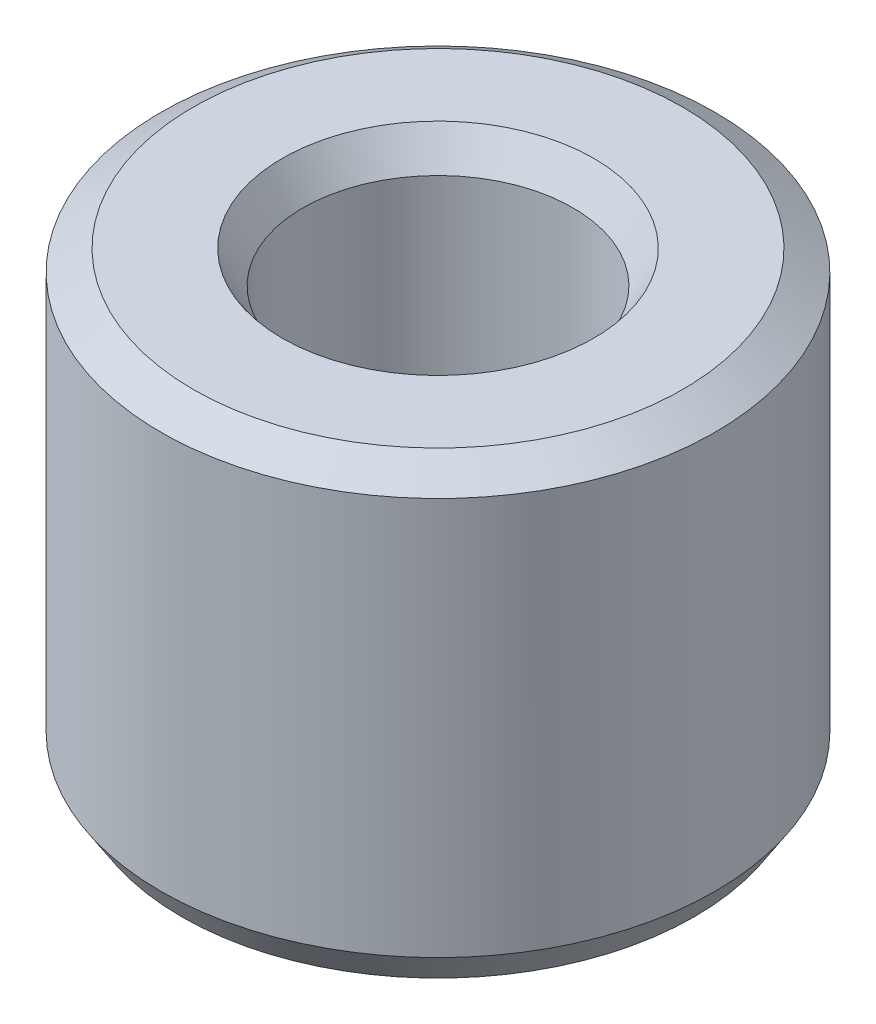
ISO-10303-21;
HEADER;
FILE_DESCRIPTION(('STEP AP214'),'2;1');
FILE_NAME('part.step','',(''),(''),'','','');
FILE_SCHEMA(('AUTOMOTIVE_DESIGN { 1 0 10303 214 1 1 1 1 }'));
ENDSEC;
DATA;
#1=APPLICATION_CONTEXT('core data for automotive mechanical design processes');
#2=APPLICATION_PROTOCOL_DEFINITION('international standard','automotive_design',2000,#1);
#3=PRODUCT_CONTEXT('',#1,'mechanical');
#4=PRODUCT('Part','Part','',(#3));
#5=PRODUCT_RELATED_PRODUCT_CATEGORY('part','',(#4));
#6=PRODUCT_DEFINITION_FORMATION('','',#4);
#7=PRODUCT_DEFINITION_CONTEXT('part definition',#1,'design');
#8=PRODUCT_DEFINITION('design','',#6,#7);
#9=PRODUCT_DEFINITION_SHAPE('','',#8);
#10=(LENGTH_UNIT() NAMED_UNIT(*) SI_UNIT(.MILLI.,.METRE.));
#11=(NAMED_UNIT(*) PLANE_ANGLE_UNIT() SI_UNIT($,.RADIAN.));
#12=(NAMED_UNIT(*) SI_UNIT($,.STERADIAN.) SOLID_ANGLE_UNIT());
#13=UNCERTAINTY_MEASURE_WITH_UNIT(LENGTH_MEASURE(1.E-05),#10,'distance_accuracy_value','');
#14=(GEOMETRIC_REPRESENTATION_CONTEXT(3) GLOBAL_UNCERTAINTY_ASSIGNED_CONTEXT((#13)) GLOBAL_UNIT_ASSIGNED_CONTEXT((#10,
#11,#12)) REPRESENTATION_CONTEXT('',''));
#15=CARTESIAN_POINT('',(0.,0.,0.));
#16=DIRECTION('',(0.,0.,1.));
#17=DIRECTION('',(1.,0.,0.));
#18=AXIS2_PLACEMENT_3D('',#15,#16,#17);
#19=CARTESIAN_POINT('',(0.,56.9371567844092,0.));
#20=DIRECTION('',(0.,-1.,0.));
#21=DIRECTION('',(0.,0.,-1.));
#22=AXIS2_PLACEMENT_3D('',#19,#20,#21);
#23=CYLINDRICAL_SURFACE('',#22,35.);
#24=CARTESIAN_POINT('',(0.,4.09853130019997,0.));
#25=DIRECTION('',(0.,1.,0.));
#26=DIRECTION('',(0.,0.,1.));
#27=AXIS2_PLACEMENT_3D('',#24,#25,#26);
#28=CIRCLE('',#27,35.);
#29=CARTESIAN_POINT('',(0.,4.09853130019997,35.));
#30=VERTEX_POINT('',#29);
#31=EDGE_CURVE('E10',#30,#30,#28,.T.);
#32=ORIENTED_EDGE('',*,*,#31,.T.);
#33=EDGE_LOOP('',(#32));
#34=FACE_BOUND('',#33,.T.);
#35=CARTESIAN_POINT('',(0.,54.3146976988478,0.));
#36=DIRECTION('',(0.,1.,0.));
#37=DIRECTION('',(0.,0.,1.));
#38=AXIS2_PLACEMENT_3D('',#35,#36,#37);
#39=CIRCLE('',#38,35.);
#40=CARTESIAN_POINT('',(0.,54.3146976988478,-35.));
#41=VERTEX_POINT('',#40);
#42=EDGE_CURVE('E50',#41,#41,#39,.F.);
#43=ORIENTED_EDGE('',*,*,#42,.T.);
#44=EDGE_LOOP('',(#43));
#45=FACE_BOUND('',#44,.T.);
#46=ADVANCED_FACE('F39',(#34,#45),#23,.T.);
#47=CARTESIAN_POINT('',(0.,56.9371567844092,0.));
#48=DIRECTION('',(0.,1.,0.));
#49=DIRECTION('',(0.,0.,1.));
#50=AXIS2_PLACEMENT_3D('',#47,#48,#49);
#51=PLANE('',#50);
#52=CARTESIAN_POINT('',(0.,56.9371567844092,0.));
#53=DIRECTION('',(0.,1.,0.));
#54=DIRECTION('',(0.,0.,1.));
#55=AXIS2_PLACEMENT_3D('',#52,#53,#54);
#56=CIRCLE('',#55,19.6767927406546);
#57=CARTESIAN_POINT('',(0.,56.9371567844092,19.6767927406546));
#58=VERTEX_POINT('',#57);
#59=EDGE_CURVE('E58',#58,#58,#56,.F.);
#60=ORIENTED_EDGE('',*,*,#59,.T.);
#61=EDGE_LOOP('',(#60));
#62=FACE_BOUND('',#61,.T.);
#63=CARTESIAN_POINT('',(0.,56.9371567844092,0.));
#64=DIRECTION('',(0.,1.,0.));
#65=DIRECTION('',(0.,0.,1.));
#66=AXIS2_PLACEMENT_3D('',#63,#64,#65);
#67=CIRCLE('',#66,30.9014686998001);
#68=CARTESIAN_POINT('',(0.,56.9371567844092,-30.9014686998001));
#69=VERTEX_POINT('',#68);
#70=EDGE_CURVE('E61',#69,#69,#67,.T.);
#71=ORIENTED_EDGE('',*,*,#70,.T.);
#72=EDGE_LOOP('',(#71));
#73=FACE_BOUND('',#72,.T.);
#74=ADVANCED_FACE('F88',(#62,#73),#51,.T.);
#75=CARTESIAN_POINT('',(0.,0.,0.));
#76=DIRECTION('',(0.,1.,0.));
#77=DIRECTION('',(0.,0.,1.));
#78=AXIS2_PLACEMENT_3D('',#75,#76,#77);
#79=PLANE('',#78);
#80=CARTESIAN_POINT('',(0.,0.,0.));
#81=DIRECTION('',(0.,1.,0.));
#82=DIRECTION('',(0.,0.,1.));
#83=AXIS2_PLACEMENT_3D('',#80,#81,#82);
#84=CIRCLE('',#83,21.1528649552931);
#85=CARTESIAN_POINT('',(0.,0.,21.1528649552931));
#86=VERTEX_POINT('',#85);
#87=EDGE_CURVE('E51',#86,#86,#84,.T.);
#88=ORIENTED_EDGE('',*,*,#87,.T.);
#89=EDGE_LOOP('',(#88));
#90=FACE_BOUND('',#89,.T.);
#91=CARTESIAN_POINT('',(0.,0.,0.));
#92=DIRECTION('',(0.,1.,0.));
#93=DIRECTION('',(0.,0.,1.));
#94=AXIS2_PLACEMENT_3D('',#91,#92,#93);
#95=CIRCLE('',#94,32.3775409144386);
#96=CARTESIAN_POINT('',(0.,0.,32.3775409144386));
#97=VERTEX_POINT('',#96);
#98=EDGE_CURVE('E54',#97,#97,#95,.F.);
#99=ORIENTED_EDGE('',*,*,#98,.T.);
#100=EDGE_LOOP('',(#99));
#101=FACE_BOUND('',#100,.T.);
#102=ADVANCED_FACE('F83',(#90,#101),#79,.F.);
#103=CARTESIAN_POINT('',(0.,56.9371567844092,0.));
#104=DIRECTION('',(0.,-1.,0.));
#105=DIRECTION('',(0.,0.,-1.));
#106=AXIS2_PLACEMENT_3D('',#103,#104,#105);
#107=CYLINDRICAL_SURFACE('',#106,17.0543336550932);
#108=CARTESIAN_POINT('',(0.,52.8386254842093,0.));
#109=DIRECTION('',(0.,1.,0.));
#110=DIRECTION('',(0.,0.,1.));
#111=AXIS2_PLACEMENT_3D('',#108,#109,#110);
#112=CIRCLE('',#111,17.0543336550932);
#113=CARTESIAN_POINT('',(0.,52.8386254842093,17.0543336550932));
#114=VERTEX_POINT('',#113);
#115=EDGE_CURVE('E67',#114,#114,#112,.T.);
#116=ORIENTED_EDGE('',*,*,#115,.T.);
#117=EDGE_LOOP('',(#116));
#118=FACE_BOUND('',#117,.T.);
#119=CARTESIAN_POINT('',(0.,2.6224590855614,0.));
#120=DIRECTION('',(0.,1.,0.));
#121=DIRECTION('',(0.,0.,1.));
#122=AXIS2_PLACEMENT_3D('',#119,#120,#121);
#123=CIRCLE('',#122,17.0543336550932);
#124=CARTESIAN_POINT('',(0.,2.6224590855614,17.0543336550932));
#125=VERTEX_POINT('',#124);
#126=EDGE_CURVE('E69',#125,#125,#123,.F.);
#127=ORIENTED_EDGE('',*,*,#126,.T.);
#128=EDGE_LOOP('',(#127));
#129=FACE_BOUND('',#128,.T.);
#130=ADVANCED_FACE('F71',(#118,#129),#107,.F.);
#131=CARTESIAN_POINT('',(0.,52.8386254842093,0.));
#132=DIRECTION('',(0.,1.,0.));
#133=DIRECTION('',(0.,0.,1.));
#134=AXIS2_PLACEMENT_3D('',#131,#132,#133);
#135=CONICAL_SURFACE('',#134,17.0543336550932,0.56920916540655);
#136=ORIENTED_EDGE('',*,*,#59,.F.);
#137=EDGE_LOOP('',(#136));
#138=FACE_BOUND('',#137,.T.);
#139=ORIENTED_EDGE('',*,*,#115,.F.);
#140=EDGE_LOOP('',(#139));
#141=FACE_BOUND('',#140,.T.);
#142=ADVANCED_FACE('F77',(#138,#141),#135,.F.);
#143=CARTESIAN_POINT('',(0.,0.,0.));
#144=DIRECTION('',(0.,-1.,0.));
#145=DIRECTION('',(0.,0.,-1.));
#146=AXIS2_PLACEMENT_3D('',#143,#144,#145);
#147=CONICAL_SURFACE('',#146,21.1528649552931,1.00158716138834);
#148=ORIENTED_EDGE('',*,*,#126,.F.);
#149=EDGE_LOOP('',(#148));
#150=FACE_BOUND('',#149,.T.);
#151=ORIENTED_EDGE('',*,*,#87,.F.);
#152=EDGE_LOOP('',(#151));
#153=FACE_BOUND('',#152,.T.);
#154=ADVANCED_FACE('F73',(#150,#153),#147,.F.);
#155=CARTESIAN_POINT('',(0.,4.09853130019997,0.));
#156=DIRECTION('',(0.,1.,0.));
#157=DIRECTION('',(0.,0.,1.));
#158=AXIS2_PLACEMENT_3D('',#155,#156,#157);
#159=CONICAL_SURFACE('',#158,35.,0.569209165406551);
#160=ORIENTED_EDGE('',*,*,#98,.F.);
#161=EDGE_LOOP('',(#160));
#162=FACE_BOUND('',#161,.T.);
#163=ORIENTED_EDGE('',*,*,#31,.F.);
#164=EDGE_LOOP('',(#163));
#165=FACE_BOUND('',#164,.T.);
#166=ADVANCED_FACE('F76',(#162,#165),#159,.T.);
#167=CARTESIAN_POINT('',(0.,56.9371567844092,0.));
#168=DIRECTION('',(0.,-1.,0.));
#169=DIRECTION('',(0.,0.,-1.));
#170=AXIS2_PLACEMENT_3D('',#167,#168,#169);
#171=CONICAL_SURFACE('',#170,30.9014686998001,1.00158716138835);
#172=CARTESIAN_POINT('',(0.,54.3146976988478,-35.));
#173=CARTESIAN_POINT('',(0.,54.3420149809891,-34.9573069656229));
#174=CARTESIAN_POINT('',(0.,54.3693322631304,-34.9146139312458));
#175=CARTESIAN_POINT('',(0.,54.4239668274129,-34.8292278624917));
#176=CARTESIAN_POINT('',(0.,54.4512841095542,-34.7865348281146));
#177=CARTESIAN_POINT('',(0.,54.5059186738367,-34.7011487593604));
#178=CARTESIAN_POINT('',(0.,54.533235955978,-34.6584557249834));
#179=CARTESIAN_POINT('',(0.,54.5878705202605,-34.5730696562292));
#180=CARTESIAN_POINT('',(0.,54.6151878024017,-34.5303766218521));
#181=CARTESIAN_POINT('',(0.,54.6698223666843,-34.4449905530979));
#182=CARTESIAN_POINT('',(0.,54.6971396488255,-34.4022975187209));
#183=CARTESIAN_POINT('',(0.,54.7517742131081,-34.3169114499667));
#184=CARTESIAN_POINT('',(0.,54.7790914952493,-34.2742184155896));
#185=CARTESIAN_POINT('',(0.,54.8337260595319,-34.1888323468355));
#186=CARTESIAN_POINT('',(0.,54.8610433416731,-34.1461393124584));
#187=CARTESIAN_POINT('',(0.,54.9156779059556,-34.0607532437042));
#188=CARTESIAN_POINT('',(0.,54.9429951880969,-34.0180602093271));
#189=CARTESIAN_POINT('',(0.,54.9976297523794,-33.932674140573));
#190=CARTESIAN_POINT('',(0.,55.0249470345207,-33.8899811061959));
#191=CARTESIAN_POINT('',(0.,55.0795815988032,-33.8045950374417));
#192=CARTESIAN_POINT('',(0.,55.1068988809445,-33.7619020030646));
#193=CARTESIAN_POINT('',(0.,55.161533445227,-33.6765159343105));
#194=CARTESIAN_POINT('',(0.,55.1888507273683,-33.6338228999334));
#195=CARTESIAN_POINT('',(0.,55.2434852916508,-33.5484368311792));
#196=CARTESIAN_POINT('',(0.,55.2708025737921,-33.5057437968021));
#197=CARTESIAN_POINT('',(0.,55.3254371380746,-33.420357728048));
#198=CARTESIAN_POINT('',(0.,55.3527544202159,-33.3776646936709));
#199=CARTESIAN_POINT('',(0.,55.4073889844984,-33.2922786249167));
#200=CARTESIAN_POINT('',(0.,55.4347062666397,-33.2495855905396));
#201=CARTESIAN_POINT('',(0.,55.4893408309222,-33.1641995217855));
#202=CARTESIAN_POINT('',(0.,55.5166581130635,-33.1215064874084));
#203=CARTESIAN_POINT('',(0.,55.571292677346,-33.0361204186542));
#204=CARTESIAN_POINT('',(0.,55.5986099594873,-32.9934273842771));
#205=CARTESIAN_POINT('',(0.,55.6532445237698,-32.908041315523));
#206=CARTESIAN_POINT('',(0.,55.6805618059111,-32.8653482811459));
#207=CARTESIAN_POINT('',(0.,55.7351963701936,-32.7799622123917));
#208=CARTESIAN_POINT('',(0.,55.7625136523348,-32.7372691780146));
#209=CARTESIAN_POINT('',(0.,55.8171482166174,-32.6518831092605));
#210=CARTESIAN_POINT('',(0.,55.8444654987586,-32.6091900748834));
#211=CARTESIAN_POINT('',(0.,55.8991000630412,-32.5238040061292));
#212=CARTESIAN_POINT('',(0.,55.9264173451824,-32.4811109717522));
#213=CARTESIAN_POINT('',(0.,55.981051909465,-32.395724902998));
#214=CARTESIAN_POINT('',(0.,56.0083691916062,-32.3530318686209));
#215=CARTESIAN_POINT('',(0.,56.0630037558888,-32.2676457998667));
#216=CARTESIAN_POINT('',(0.,56.09032103803,-32.2249527654897));
#217=CARTESIAN_POINT('',(0.,56.1449556023125,-32.1395666967355));
#218=CARTESIAN_POINT('',(0.,56.1722728844538,-32.0968736623584));
#219=CARTESIAN_POINT('',(0.,56.2269074487363,-32.0114875936042));
#220=CARTESIAN_POINT('',(0.,56.2542247308776,-31.9687945592272));
#221=CARTESIAN_POINT('',(0.,56.3088592951601,-31.883408490473));
#222=CARTESIAN_POINT('',(0.,56.3361765773014,-31.8407154560959));
#223=CARTESIAN_POINT('',(0.,56.3908111415839,-31.7553293873417));
#224=CARTESIAN_POINT('',(0.,56.4181284237252,-31.7126363529647));
#225=CARTESIAN_POINT('',(0.,56.4727629880077,-31.6272502842105));
#226=CARTESIAN_POINT('',(0.,56.500080270149,-31.5845572498334));
#227=CARTESIAN_POINT('',(0.,56.5547148344315,-31.4991711810793));
#228=CARTESIAN_POINT('',(0.,56.5820321165728,-31.4564781467022));
#229=CARTESIAN_POINT('',(0.,56.6366666808553,-31.371092077948));
#230=CARTESIAN_POINT('',(0.,56.6639839629966,-31.3283990435709));
#231=CARTESIAN_POINT('',(0.,56.7186185272791,-31.2430129748168));
#232=CARTESIAN_POINT('',(0.,56.7459358094204,-31.2003199404397));
#233=CARTESIAN_POINT('',(0.,56.8005703737029,-31.1149338716855));
#234=CARTESIAN_POINT('',(0.,56.8278876558442,-31.0722408373084));
#235=CARTESIAN_POINT('',(0.,56.8825222201267,-30.9868547685543));
#236=CARTESIAN_POINT('',(0.,56.9098395022679,-30.9441617341772));
#237=CARTESIAN_POINT('',(0.,56.9371567844092,-30.9014686998001));
#238=B_SPLINE_CURVE_WITH_KNOTS('',3,(#172,#173,#174,#175,#176,#177,#178,#179,#180,#181,#182,
#183,#184,#185,#186,#187,#188,#189,#190,#191,#192,#193,#194,#195,#196,#197,#198,#199,#200,#201,
#202,#203,#204,#205,#206,#207,#208,#209,#210,#211,#212,#213,#214,#215,#216,#217,#218,#219,#220,
#221,#222,#223,#224,#225,#226,#227,#228,#229,#230,#231,#232,#233,#234,#235,#236,#237),
.UNSPECIFIED.,.F.,.F.,(4,2,2,2,2,2,2,2,2,2,2,2,2,2,2,2,2,2,2,2,2,2,2,2,2,2,2,2,2,2,2,2,4),(0.,
0.152053812156009,0.304107624312011,0.456161436468016,0.608215248624025,0.760269060780024,
0.912322872936032,1.06437668509204,1.21643049724804,1.36848430940405,1.52053812156005,
1.67259193371606,1.82464574587206,1.97669955802807,2.12875337018407,2.28080718234008,
2.43286099449609,2.58491480665209,2.73696861880809,2.8890224309641,3.0410762431201,
3.19313005527611,3.34518386743212,3.49723767958812,3.64929149174413,3.80134530390013,
3.95339911605613,4.10545292821214,4.25750674036815,4.40956055252415,4.56161436468015,
4.71366817683616,4.86572198899217),.UNSPECIFIED.);
#239=EDGE_CURVE('BSEAM45',#41,#69,#238,.T.);
#240=ORIENTED_EDGE('',*,*,#42,.F.);
#241=ORIENTED_EDGE('',*,*,#70,.F.);
#242=ORIENTED_EDGE('',*,*,#239,.T.);
#243=ORIENTED_EDGE('',*,*,#239,.F.);
#244=EDGE_LOOP('',(#240,#242,#241,#243));
#245=FACE_BOUND('',#244,.T.);
#246=ADVANCED_FACE('F45',(#245),#171,.T.);
#247=CLOSED_SHELL('',(#46,#74,#102,#130,#142,#154,#166,#246));
#248=MANIFOLD_SOLID_BREP('B2',#247);
#249=ADVANCED_BREP_SHAPE_REPRESENTATION('',(#18,#248),#14);
#250=SHAPE_DEFINITION_REPRESENTATION(#9,#249);
ENDSEC;
END-ISO-10303-21;
